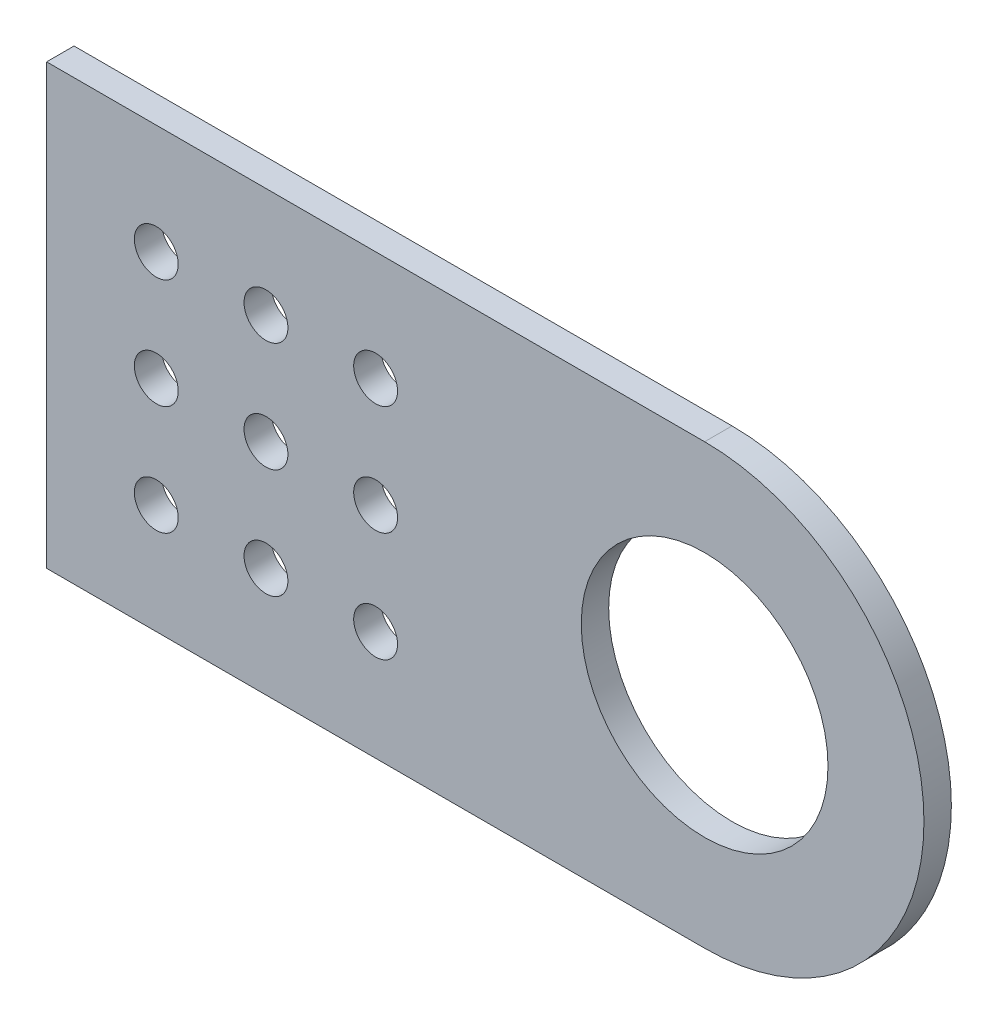
ISO-10303-21;
HEADER;
FILE_DESCRIPTION(('STEP AP214'),'2;1');
FILE_NAME('part.step','',(''),(''),'','','');
FILE_SCHEMA(('AUTOMOTIVE_DESIGN { 1 0 10303 214 1 1 1 1 }'));
ENDSEC;
DATA;
#1=APPLICATION_CONTEXT('core data for automotive mechanical design processes');
#2=APPLICATION_PROTOCOL_DEFINITION('international standard','automotive_design',2000,#1);
#3=PRODUCT_CONTEXT('',#1,'mechanical');
#4=PRODUCT('Part','Part','',(#3));
#5=PRODUCT_RELATED_PRODUCT_CATEGORY('part','',(#4));
#6=PRODUCT_DEFINITION_FORMATION('','',#4);
#7=PRODUCT_DEFINITION_CONTEXT('part definition',#1,'design');
#8=PRODUCT_DEFINITION('design','',#6,#7);
#9=PRODUCT_DEFINITION_SHAPE('','',#8);
#10=(LENGTH_UNIT() NAMED_UNIT(*) SI_UNIT(.MILLI.,.METRE.));
#11=(NAMED_UNIT(*) PLANE_ANGLE_UNIT() SI_UNIT($,.RADIAN.));
#12=(NAMED_UNIT(*) SI_UNIT($,.STERADIAN.) SOLID_ANGLE_UNIT());
#13=UNCERTAINTY_MEASURE_WITH_UNIT(LENGTH_MEASURE(1.E-05),#10,'distance_accuracy_value','');
#14=(GEOMETRIC_REPRESENTATION_CONTEXT(3) GLOBAL_UNCERTAINTY_ASSIGNED_CONTEXT((#13)) GLOBAL_UNIT_ASSIGNED_CONTEXT((#10,
#11,#12)) REPRESENTATION_CONTEXT('',''));
#15=CARTESIAN_POINT('',(0.,0.,0.));
#16=DIRECTION('',(0.,0.,1.));
#17=DIRECTION('',(1.,0.,0.));
#18=AXIS2_PLACEMENT_3D('',#15,#16,#17);
#19=CARTESIAN_POINT('',(76.2,25.3999999999999,3.175));
#20=DIRECTION('',(0.,0.,-1.));
#21=DIRECTION('',(-1.,0.,0.));
#22=AXIS2_PLACEMENT_3D('',#19,#20,#21);
#23=PLANE('',#22);
#24=DIRECTION('',(1.,0.,0.));
#25=VECTOR('',#24,1.);
#26=CARTESIAN_POINT('',(76.2,0.,3.175));
#27=LINE('',#26,#25);
#28=CARTESIAN_POINT('',(0.,0.,3.175));
#29=VERTEX_POINT('',#28);
#30=CARTESIAN_POINT('',(76.2,0.,3.175));
#31=VERTEX_POINT('',#30);
#32=EDGE_CURVE('E91',#29,#31,#27,.T.);
#33=ORIENTED_EDGE('',*,*,#32,.T.);
#34=CARTESIAN_POINT('',(76.2,25.3999999999999,3.175));
#35=DIRECTION('',(0.,0.,1.));
#36=DIRECTION('',(-1.,0.,0.));
#37=AXIS2_PLACEMENT_3D('',#34,#35,#36);
#38=CIRCLE('',#37,25.4);
#39=CARTESIAN_POINT('',(76.2,50.7999999999999,3.175));
#40=VERTEX_POINT('',#39);
#41=EDGE_CURVE('E86',#31,#40,#38,.T.);
#42=ORIENTED_EDGE('',*,*,#41,.T.);
#43=DIRECTION('',(-1.,0.,0.));
#44=VECTOR('',#43,1.);
#45=CARTESIAN_POINT('',(0.,50.7999999999999,3.175));
#46=LINE('',#45,#44);
#47=CARTESIAN_POINT('',(0.,50.7999999999999,3.175));
#48=VERTEX_POINT('',#47);
#49=EDGE_CURVE('E89',#40,#48,#46,.T.);
#50=ORIENTED_EDGE('',*,*,#49,.T.);
#51=DIRECTION('',(0.,-1.,0.));
#52=VECTOR('',#51,1.);
#53=CARTESIAN_POINT('',(0.,0.,3.175));
#54=LINE('',#53,#52);
#55=EDGE_CURVE('E56',#48,#29,#54,.T.);
#56=ORIENTED_EDGE('',*,*,#55,.T.);
#57=EDGE_LOOP('',(#33,#42,#50,#56));
#58=FACE_BOUND('',#57,.T.);
#59=CARTESIAN_POINT('',(12.7,38.0999999999999,3.175));
#60=DIRECTION('',(0.,0.,1.));
#61=DIRECTION('',(1.,0.,0.));
#62=AXIS2_PLACEMENT_3D('',#59,#60,#61);
#63=CIRCLE('',#62,2.54);
#64=CARTESIAN_POINT('',(15.24,38.0999999999999,3.175));
#65=VERTEX_POINT('',#64);
#66=EDGE_CURVE('E106',#65,#65,#63,.T.);
#67=ORIENTED_EDGE('',*,*,#66,.F.);
#68=EDGE_LOOP('',(#67));
#69=FACE_BOUND('',#68,.T.);
#70=CARTESIAN_POINT('',(76.2,25.3999999999999,3.175));
#71=DIRECTION('',(0.,0.,1.));
#72=DIRECTION('',(1.,0.,0.));
#73=AXIS2_PLACEMENT_3D('',#70,#71,#72);
#74=CIRCLE('',#73,14.2875);
#75=CARTESIAN_POINT('',(90.4875,25.3999999999999,3.175));
#76=VERTEX_POINT('',#75);
#77=EDGE_CURVE('E121',#76,#76,#74,.T.);
#78=ORIENTED_EDGE('',*,*,#77,.F.);
#79=EDGE_LOOP('',(#78));
#80=FACE_BOUND('',#79,.T.);
#81=CARTESIAN_POINT('',(25.4,38.0999999999999,3.175));
#82=DIRECTION('',(0.,0.,1.));
#83=DIRECTION('',(1.,0.,0.));
#84=AXIS2_PLACEMENT_3D('',#81,#82,#83);
#85=CIRCLE('',#84,2.54);
#86=CARTESIAN_POINT('',(27.94,38.0999999999999,3.175));
#87=VERTEX_POINT('',#86);
#88=EDGE_CURVE('E127',#87,#87,#85,.T.);
#89=ORIENTED_EDGE('',*,*,#88,.F.);
#90=EDGE_LOOP('',(#89));
#91=FACE_BOUND('',#90,.T.);
#92=CARTESIAN_POINT('',(38.1,38.0999999999999,3.175));
#93=DIRECTION('',(0.,0.,1.));
#94=DIRECTION('',(1.,0.,0.));
#95=AXIS2_PLACEMENT_3D('',#92,#93,#94);
#96=CIRCLE('',#95,2.54);
#97=CARTESIAN_POINT('',(40.64,38.0999999999999,3.175));
#98=VERTEX_POINT('',#97);
#99=EDGE_CURVE('E133',#98,#98,#96,.T.);
#100=ORIENTED_EDGE('',*,*,#99,.F.);
#101=EDGE_LOOP('',(#100));
#102=FACE_BOUND('',#101,.T.);
#103=CARTESIAN_POINT('',(25.4,25.3999999999999,3.175));
#104=DIRECTION('',(0.,0.,1.));
#105=DIRECTION('',(1.,0.,0.));
#106=AXIS2_PLACEMENT_3D('',#103,#104,#105);
#107=CIRCLE('',#106,2.54);
#108=CARTESIAN_POINT('',(27.94,25.3999999999999,3.175));
#109=VERTEX_POINT('',#108);
#110=EDGE_CURVE('E139',#109,#109,#107,.T.);
#111=ORIENTED_EDGE('',*,*,#110,.F.);
#112=EDGE_LOOP('',(#111));
#113=FACE_BOUND('',#112,.T.);
#114=CARTESIAN_POINT('',(38.1,25.3999999999999,3.175));
#115=DIRECTION('',(0.,0.,1.));
#116=DIRECTION('',(1.,0.,0.));
#117=AXIS2_PLACEMENT_3D('',#114,#115,#116);
#118=CIRCLE('',#117,2.54);
#119=CARTESIAN_POINT('',(40.64,25.3999999999999,3.175));
#120=VERTEX_POINT('',#119);
#121=EDGE_CURVE('E145',#120,#120,#118,.T.);
#122=ORIENTED_EDGE('',*,*,#121,.F.);
#123=EDGE_LOOP('',(#122));
#124=FACE_BOUND('',#123,.T.);
#125=CARTESIAN_POINT('',(25.4,12.6999999999999,3.175));
#126=DIRECTION('',(0.,0.,1.));
#127=DIRECTION('',(1.,0.,0.));
#128=AXIS2_PLACEMENT_3D('',#125,#126,#127);
#129=CIRCLE('',#128,2.54);
#130=CARTESIAN_POINT('',(27.94,12.6999999999999,3.175));
#131=VERTEX_POINT('',#130);
#132=EDGE_CURVE('E151',#131,#131,#129,.T.);
#133=ORIENTED_EDGE('',*,*,#132,.F.);
#134=EDGE_LOOP('',(#133));
#135=FACE_BOUND('',#134,.T.);
#136=CARTESIAN_POINT('',(38.1,12.6999999999999,3.175));
#137=DIRECTION('',(0.,0.,1.));
#138=DIRECTION('',(1.,0.,0.));
#139=AXIS2_PLACEMENT_3D('',#136,#137,#138);
#140=CIRCLE('',#139,2.54);
#141=CARTESIAN_POINT('',(40.64,12.6999999999999,3.175));
#142=VERTEX_POINT('',#141);
#143=EDGE_CURVE('E157',#142,#142,#140,.T.);
#144=ORIENTED_EDGE('',*,*,#143,.F.);
#145=EDGE_LOOP('',(#144));
#146=FACE_BOUND('',#145,.T.);
#147=CARTESIAN_POINT('',(12.7,25.3999999999999,3.175));
#148=DIRECTION('',(0.,0.,1.));
#149=DIRECTION('',(1.,0.,0.));
#150=AXIS2_PLACEMENT_3D('',#147,#148,#149);
#151=CIRCLE('',#150,2.54);
#152=CARTESIAN_POINT('',(15.24,25.3999999999999,3.175));
#153=VERTEX_POINT('',#152);
#154=EDGE_CURVE('E163',#153,#153,#151,.T.);
#155=ORIENTED_EDGE('',*,*,#154,.F.);
#156=EDGE_LOOP('',(#155));
#157=FACE_BOUND('',#156,.T.);
#158=CARTESIAN_POINT('',(12.7,12.6999999999999,3.175));
#159=DIRECTION('',(0.,0.,1.));
#160=DIRECTION('',(1.,0.,0.));
#161=AXIS2_PLACEMENT_3D('',#158,#159,#160);
#162=CIRCLE('',#161,2.54);
#163=CARTESIAN_POINT('',(15.24,12.6999999999999,3.175));
#164=VERTEX_POINT('',#163);
#165=EDGE_CURVE('E169',#164,#164,#162,.T.);
#166=ORIENTED_EDGE('',*,*,#165,.F.);
#167=EDGE_LOOP('',(#166));
#168=FACE_BOUND('',#167,.T.);
#169=ADVANCED_FACE('F39',(#58,#69,#80,#91,#102,#113,#124,#135,#146,#157,#168),#23,.F.);
#170=CARTESIAN_POINT('',(76.2,25.3999999999999,0.));
#171=DIRECTION('',(0.,0.,-1.));
#172=DIRECTION('',(-1.,0.,0.));
#173=AXIS2_PLACEMENT_3D('',#170,#171,#172);
#174=PLANE('',#173);
#175=CARTESIAN_POINT('',(12.7,25.3999999999999,0.));
#176=DIRECTION('',(0.,0.,1.));
#177=DIRECTION('',(1.,0.,0.));
#178=AXIS2_PLACEMENT_3D('',#175,#176,#177);
#179=CIRCLE('',#178,2.54);
#180=CARTESIAN_POINT('',(15.24,25.3999999999999,0.));
#181=VERTEX_POINT('',#180);
#182=EDGE_CURVE('E166',#181,#181,#179,.T.);
#183=ORIENTED_EDGE('',*,*,#182,.T.);
#184=EDGE_LOOP('',(#183));
#185=FACE_BOUND('',#184,.T.);
#186=CARTESIAN_POINT('',(25.4,12.6999999999999,0.));
#187=DIRECTION('',(0.,0.,1.));
#188=DIRECTION('',(1.,0.,0.));
#189=AXIS2_PLACEMENT_3D('',#186,#187,#188);
#190=CIRCLE('',#189,2.54);
#191=CARTESIAN_POINT('',(27.94,12.6999999999999,0.));
#192=VERTEX_POINT('',#191);
#193=EDGE_CURVE('E154',#192,#192,#190,.T.);
#194=ORIENTED_EDGE('',*,*,#193,.T.);
#195=EDGE_LOOP('',(#194));
#196=FACE_BOUND('',#195,.T.);
#197=CARTESIAN_POINT('',(25.4,25.3999999999999,0.));
#198=DIRECTION('',(0.,0.,1.));
#199=DIRECTION('',(1.,0.,0.));
#200=AXIS2_PLACEMENT_3D('',#197,#198,#199);
#201=CIRCLE('',#200,2.54);
#202=CARTESIAN_POINT('',(27.94,25.3999999999999,0.));
#203=VERTEX_POINT('',#202);
#204=EDGE_CURVE('E142',#203,#203,#201,.T.);
#205=ORIENTED_EDGE('',*,*,#204,.T.);
#206=EDGE_LOOP('',(#205));
#207=FACE_BOUND('',#206,.T.);
#208=CARTESIAN_POINT('',(25.4,38.0999999999999,0.));
#209=DIRECTION('',(0.,0.,1.));
#210=DIRECTION('',(1.,0.,0.));
#211=AXIS2_PLACEMENT_3D('',#208,#209,#210);
#212=CIRCLE('',#211,2.54);
#213=CARTESIAN_POINT('',(27.94,38.0999999999999,0.));
#214=VERTEX_POINT('',#213);
#215=EDGE_CURVE('E130',#214,#214,#212,.T.);
#216=ORIENTED_EDGE('',*,*,#215,.T.);
#217=EDGE_LOOP('',(#216));
#218=FACE_BOUND('',#217,.T.);
#219=CARTESIAN_POINT('',(12.7,38.0999999999999,0.));
#220=DIRECTION('',(0.,0.,1.));
#221=DIRECTION('',(1.,0.,0.));
#222=AXIS2_PLACEMENT_3D('',#219,#220,#221);
#223=CIRCLE('',#222,2.54);
#224=CARTESIAN_POINT('',(15.24,38.0999999999999,0.));
#225=VERTEX_POINT('',#224);
#226=EDGE_CURVE('E118',#225,#225,#223,.T.);
#227=ORIENTED_EDGE('',*,*,#226,.T.);
#228=EDGE_LOOP('',(#227));
#229=FACE_BOUND('',#228,.T.);
#230=DIRECTION('',(1.,0.,0.));
#231=VECTOR('',#230,1.);
#232=CARTESIAN_POINT('',(76.2,0.,0.));
#233=LINE('',#232,#231);
#234=CARTESIAN_POINT('',(0.,0.,0.));
#235=VERTEX_POINT('',#234);
#236=CARTESIAN_POINT('',(76.2,0.,0.));
#237=VERTEX_POINT('',#236);
#238=EDGE_CURVE('E103',#235,#237,#233,.T.);
#239=ORIENTED_EDGE('',*,*,#238,.F.);
#240=DIRECTION('',(0.,-1.,0.));
#241=VECTOR('',#240,1.);
#242=CARTESIAN_POINT('',(0.,0.,0.));
#243=LINE('',#242,#241);
#244=CARTESIAN_POINT('',(0.,50.7999999999999,0.));
#245=VERTEX_POINT('',#244);
#246=EDGE_CURVE('E79',#245,#235,#243,.T.);
#247=ORIENTED_EDGE('',*,*,#246,.F.);
#248=DIRECTION('',(-1.,0.,0.));
#249=VECTOR('',#248,1.);
#250=CARTESIAN_POINT('',(0.,50.7999999999999,0.));
#251=LINE('',#250,#249);
#252=CARTESIAN_POINT('',(76.2,50.7999999999999,0.));
#253=VERTEX_POINT('',#252);
#254=EDGE_CURVE('E73',#253,#245,#251,.T.);
#255=ORIENTED_EDGE('',*,*,#254,.F.);
#256=CARTESIAN_POINT('',(76.2,25.3999999999999,0.));
#257=DIRECTION('',(0.,0.,1.));
#258=DIRECTION('',(-1.,0.,0.));
#259=AXIS2_PLACEMENT_3D('',#256,#257,#258);
#260=CIRCLE('',#259,25.4);
#261=EDGE_CURVE('E95',#237,#253,#260,.T.);
#262=ORIENTED_EDGE('',*,*,#261,.F.);
#263=EDGE_LOOP('',(#239,#247,#255,#262));
#264=FACE_BOUND('',#263,.T.);
#265=CARTESIAN_POINT('',(76.2,25.3999999999999,0.));
#266=DIRECTION('',(0.,0.,1.));
#267=DIRECTION('',(1.,0.,0.));
#268=AXIS2_PLACEMENT_3D('',#265,#266,#267);
#269=CIRCLE('',#268,14.2875);
#270=CARTESIAN_POINT('',(90.4875,25.3999999999999,0.));
#271=VERTEX_POINT('',#270);
#272=EDGE_CURVE('E124',#271,#271,#269,.T.);
#273=ORIENTED_EDGE('',*,*,#272,.T.);
#274=EDGE_LOOP('',(#273));
#275=FACE_BOUND('',#274,.T.);
#276=CARTESIAN_POINT('',(38.1,38.0999999999999,0.));
#277=DIRECTION('',(0.,0.,1.));
#278=DIRECTION('',(1.,0.,0.));
#279=AXIS2_PLACEMENT_3D('',#276,#277,#278);
#280=CIRCLE('',#279,2.54);
#281=CARTESIAN_POINT('',(40.64,38.0999999999999,0.));
#282=VERTEX_POINT('',#281);
#283=EDGE_CURVE('E136',#282,#282,#280,.T.);
#284=ORIENTED_EDGE('',*,*,#283,.T.);
#285=EDGE_LOOP('',(#284));
#286=FACE_BOUND('',#285,.T.);
#287=CARTESIAN_POINT('',(38.1,25.3999999999999,0.));
#288=DIRECTION('',(0.,0.,1.));
#289=DIRECTION('',(1.,0.,0.));
#290=AXIS2_PLACEMENT_3D('',#287,#288,#289);
#291=CIRCLE('',#290,2.54);
#292=CARTESIAN_POINT('',(40.64,25.3999999999999,0.));
#293=VERTEX_POINT('',#292);
#294=EDGE_CURVE('E148',#293,#293,#291,.T.);
#295=ORIENTED_EDGE('',*,*,#294,.T.);
#296=EDGE_LOOP('',(#295));
#297=FACE_BOUND('',#296,.T.);
#298=CARTESIAN_POINT('',(38.1,12.6999999999999,0.));
#299=DIRECTION('',(0.,0.,1.));
#300=DIRECTION('',(1.,0.,0.));
#301=AXIS2_PLACEMENT_3D('',#298,#299,#300);
#302=CIRCLE('',#301,2.54);
#303=CARTESIAN_POINT('',(40.64,12.6999999999999,0.));
#304=VERTEX_POINT('',#303);
#305=EDGE_CURVE('E160',#304,#304,#302,.T.);
#306=ORIENTED_EDGE('',*,*,#305,.T.);
#307=EDGE_LOOP('',(#306));
#308=FACE_BOUND('',#307,.T.);
#309=CARTESIAN_POINT('',(12.7,12.6999999999999,0.));
#310=DIRECTION('',(0.,0.,1.));
#311=DIRECTION('',(1.,0.,0.));
#312=AXIS2_PLACEMENT_3D('',#309,#310,#311);
#313=CIRCLE('',#312,2.54);
#314=CARTESIAN_POINT('',(15.24,12.6999999999999,0.));
#315=VERTEX_POINT('',#314);
#316=EDGE_CURVE('E172',#315,#315,#313,.T.);
#317=ORIENTED_EDGE('',*,*,#316,.T.);
#318=EDGE_LOOP('',(#317));
#319=FACE_BOUND('',#318,.T.);
#320=ADVANCED_FACE('F114',(#185,#196,#207,#218,#229,#264,#275,#286,#297,#308,#319),#174,.T.);
#321=CARTESIAN_POINT('',(76.2,0.,3.175));
#322=DIRECTION('',(0.,1.,0.));
#323=DIRECTION('',(-1.,0.,0.));
#324=AXIS2_PLACEMENT_3D('',#321,#322,#323);
#325=PLANE('',#324);
#326=ORIENTED_EDGE('',*,*,#238,.T.);
#327=DIRECTION('',(0.,0.,-1.));
#328=VECTOR('',#327,1.);
#329=CARTESIAN_POINT('',(76.2,0.,3.175));
#330=LINE('',#329,#328);
#331=EDGE_CURVE('E11',#31,#237,#330,.T.);
#332=ORIENTED_EDGE('',*,*,#331,.F.);
#333=ORIENTED_EDGE('',*,*,#32,.F.);
#334=DIRECTION('',(0.,0.,-1.));
#335=VECTOR('',#334,1.);
#336=CARTESIAN_POINT('',(0.,0.,3.175));
#337=LINE('',#336,#335);
#338=EDGE_CURVE('E99',#29,#235,#337,.T.);
#339=ORIENTED_EDGE('',*,*,#338,.T.);
#340=EDGE_LOOP('',(#326,#332,#333,#339));
#341=FACE_BOUND('',#340,.T.);
#342=ADVANCED_FACE('F41',(#341),#325,.F.);
#343=CARTESIAN_POINT('',(76.2,25.3999999999999,3.175));
#344=DIRECTION('',(0.,0.,-1.));
#345=DIRECTION('',(-1.,0.,0.));
#346=AXIS2_PLACEMENT_3D('',#343,#344,#345);
#347=CYLINDRICAL_SURFACE('',#346,25.4);
#348=ORIENTED_EDGE('',*,*,#261,.T.);
#349=DIRECTION('',(0.,0.,-1.));
#350=VECTOR('',#349,1.);
#351=CARTESIAN_POINT('',(76.2,50.7999999999999,3.175));
#352=LINE('',#351,#350);
#353=EDGE_CURVE('E48',#40,#253,#352,.T.);
#354=ORIENTED_EDGE('',*,*,#353,.F.);
#355=ORIENTED_EDGE('',*,*,#41,.F.);
#356=ORIENTED_EDGE('',*,*,#331,.T.);
#357=EDGE_LOOP('',(#348,#354,#355,#356));
#358=FACE_BOUND('',#357,.T.);
#359=ADVANCED_FACE('F94',(#358),#347,.T.);
#360=CARTESIAN_POINT('',(0.,50.7999999999999,3.175));
#361=DIRECTION('',(0.,-1.,0.));
#362=DIRECTION('',(0.,0.,-1.));
#363=AXIS2_PLACEMENT_3D('',#360,#361,#362);
#364=PLANE('',#363);
#365=ORIENTED_EDGE('',*,*,#254,.T.);
#366=DIRECTION('',(0.,0.,-1.));
#367=VECTOR('',#366,1.);
#368=CARTESIAN_POINT('',(0.,50.7999999999999,3.175));
#369=LINE('',#368,#367);
#370=EDGE_CURVE('E96',#48,#245,#369,.T.);
#371=ORIENTED_EDGE('',*,*,#370,.F.);
#372=ORIENTED_EDGE('',*,*,#49,.F.);
#373=ORIENTED_EDGE('',*,*,#353,.T.);
#374=EDGE_LOOP('',(#365,#371,#372,#373));
#375=FACE_BOUND('',#374,.T.);
#376=ADVANCED_FACE('F97',(#375),#364,.F.);
#377=CARTESIAN_POINT('',(0.,0.,3.175));
#378=DIRECTION('',(1.,0.,0.));
#379=DIRECTION('',(0.,1.,0.));
#380=AXIS2_PLACEMENT_3D('',#377,#378,#379);
#381=PLANE('',#380);
#382=ORIENTED_EDGE('',*,*,#246,.T.);
#383=ORIENTED_EDGE('',*,*,#338,.F.);
#384=ORIENTED_EDGE('',*,*,#55,.F.);
#385=ORIENTED_EDGE('',*,*,#370,.T.);
#386=EDGE_LOOP('',(#382,#383,#384,#385));
#387=FACE_BOUND('',#386,.T.);
#388=ADVANCED_FACE('F111',(#387),#381,.F.);
#389=CARTESIAN_POINT('',(12.7,38.0999999999999,3.175));
#390=DIRECTION('',(0.,0.,-1.));
#391=DIRECTION('',(-1.,0.,0.));
#392=AXIS2_PLACEMENT_3D('',#389,#390,#391);
#393=CYLINDRICAL_SURFACE('',#392,2.54);
#394=ORIENTED_EDGE('',*,*,#66,.T.);
#395=EDGE_LOOP('',(#394));
#396=FACE_BOUND('',#395,.T.);
#397=ORIENTED_EDGE('',*,*,#226,.F.);
#398=EDGE_LOOP('',(#397));
#399=FACE_BOUND('',#398,.T.);
#400=ADVANCED_FACE('F189',(#396,#399),#393,.F.);
#401=CARTESIAN_POINT('',(76.2,25.3999999999999,3.175));
#402=DIRECTION('',(0.,0.,-1.));
#403=DIRECTION('',(-1.,0.,0.));
#404=AXIS2_PLACEMENT_3D('',#401,#402,#403);
#405=CYLINDRICAL_SURFACE('',#404,14.2875);
#406=ORIENTED_EDGE('',*,*,#77,.T.);
#407=EDGE_LOOP('',(#406));
#408=FACE_BOUND('',#407,.T.);
#409=ORIENTED_EDGE('',*,*,#272,.F.);
#410=EDGE_LOOP('',(#409));
#411=FACE_BOUND('',#410,.T.);
#412=ADVANCED_FACE('F234',(#408,#411),#405,.F.);
#413=CARTESIAN_POINT('',(25.4,38.0999999999999,3.175));
#414=DIRECTION('',(0.,0.,-1.));
#415=DIRECTION('',(-1.,0.,0.));
#416=AXIS2_PLACEMENT_3D('',#413,#414,#415);
#417=CYLINDRICAL_SURFACE('',#416,2.54);
#418=ORIENTED_EDGE('',*,*,#88,.T.);
#419=EDGE_LOOP('',(#418));
#420=FACE_BOUND('',#419,.T.);
#421=ORIENTED_EDGE('',*,*,#215,.F.);
#422=EDGE_LOOP('',(#421));
#423=FACE_BOUND('',#422,.T.);
#424=ADVANCED_FACE('F242',(#420,#423),#417,.F.);
#425=CARTESIAN_POINT('',(38.1,38.0999999999999,3.175));
#426=DIRECTION('',(0.,0.,-1.));
#427=DIRECTION('',(-1.,0.,0.));
#428=AXIS2_PLACEMENT_3D('',#425,#426,#427);
#429=CYLINDRICAL_SURFACE('',#428,2.54);
#430=ORIENTED_EDGE('',*,*,#99,.T.);
#431=EDGE_LOOP('',(#430));
#432=FACE_BOUND('',#431,.T.);
#433=ORIENTED_EDGE('',*,*,#283,.F.);
#434=EDGE_LOOP('',(#433));
#435=FACE_BOUND('',#434,.T.);
#436=ADVANCED_FACE('F250',(#432,#435),#429,.F.);
#437=CARTESIAN_POINT('',(25.4,25.3999999999999,3.175));
#438=DIRECTION('',(0.,0.,-1.));
#439=DIRECTION('',(-1.,0.,0.));
#440=AXIS2_PLACEMENT_3D('',#437,#438,#439);
#441=CYLINDRICAL_SURFACE('',#440,2.54);
#442=ORIENTED_EDGE('',*,*,#110,.T.);
#443=EDGE_LOOP('',(#442));
#444=FACE_BOUND('',#443,.T.);
#445=ORIENTED_EDGE('',*,*,#204,.F.);
#446=EDGE_LOOP('',(#445));
#447=FACE_BOUND('',#446,.T.);
#448=ADVANCED_FACE('F259',(#444,#447),#441,.F.);
#449=CARTESIAN_POINT('',(38.1,25.3999999999999,3.175));
#450=DIRECTION('',(0.,0.,-1.));
#451=DIRECTION('',(-1.,0.,0.));
#452=AXIS2_PLACEMENT_3D('',#449,#450,#451);
#453=CYLINDRICAL_SURFACE('',#452,2.54);
#454=ORIENTED_EDGE('',*,*,#121,.T.);
#455=EDGE_LOOP('',(#454));
#456=FACE_BOUND('',#455,.T.);
#457=ORIENTED_EDGE('',*,*,#294,.F.);
#458=EDGE_LOOP('',(#457));
#459=FACE_BOUND('',#458,.T.);
#460=ADVANCED_FACE('F268',(#456,#459),#453,.F.);
#461=CARTESIAN_POINT('',(25.4,12.6999999999999,3.175));
#462=DIRECTION('',(0.,0.,-1.));
#463=DIRECTION('',(-1.,0.,0.));
#464=AXIS2_PLACEMENT_3D('',#461,#462,#463);
#465=CYLINDRICAL_SURFACE('',#464,2.54);
#466=ORIENTED_EDGE('',*,*,#132,.T.);
#467=EDGE_LOOP('',(#466));
#468=FACE_BOUND('',#467,.T.);
#469=ORIENTED_EDGE('',*,*,#193,.F.);
#470=EDGE_LOOP('',(#469));
#471=FACE_BOUND('',#470,.T.);
#472=ADVANCED_FACE('F277',(#468,#471),#465,.F.);
#473=CARTESIAN_POINT('',(38.1,12.6999999999999,3.175));
#474=DIRECTION('',(0.,0.,-1.));
#475=DIRECTION('',(-1.,0.,0.));
#476=AXIS2_PLACEMENT_3D('',#473,#474,#475);
#477=CYLINDRICAL_SURFACE('',#476,2.54);
#478=ORIENTED_EDGE('',*,*,#143,.T.);
#479=EDGE_LOOP('',(#478));
#480=FACE_BOUND('',#479,.T.);
#481=ORIENTED_EDGE('',*,*,#305,.F.);
#482=EDGE_LOOP('',(#481));
#483=FACE_BOUND('',#482,.T.);
#484=ADVANCED_FACE('F286',(#480,#483),#477,.F.);
#485=CARTESIAN_POINT('',(12.7,25.3999999999999,3.175));
#486=DIRECTION('',(0.,0.,-1.));
#487=DIRECTION('',(-1.,0.,0.));
#488=AXIS2_PLACEMENT_3D('',#485,#486,#487);
#489=CYLINDRICAL_SURFACE('',#488,2.54);
#490=ORIENTED_EDGE('',*,*,#154,.T.);
#491=EDGE_LOOP('',(#490));
#492=FACE_BOUND('',#491,.T.);
#493=ORIENTED_EDGE('',*,*,#182,.F.);
#494=EDGE_LOOP('',(#493));
#495=FACE_BOUND('',#494,.T.);
#496=ADVANCED_FACE('F295',(#492,#495),#489,.F.);
#497=CARTESIAN_POINT('',(12.7,12.6999999999999,3.175));
#498=DIRECTION('',(0.,0.,-1.));
#499=DIRECTION('',(-1.,0.,0.));
#500=AXIS2_PLACEMENT_3D('',#497,#498,#499);
#501=CYLINDRICAL_SURFACE('',#500,2.54);
#502=ORIENTED_EDGE('',*,*,#165,.T.);
#503=EDGE_LOOP('',(#502));
#504=FACE_BOUND('',#503,.T.);
#505=ORIENTED_EDGE('',*,*,#316,.F.);
#506=EDGE_LOOP('',(#505));
#507=FACE_BOUND('',#506,.T.);
#508=ADVANCED_FACE('F178',(#504,#507),#501,.F.);
#509=CLOSED_SHELL('',(#169,#320,#342,#359,#376,#388,#400,#412,#424,#436,#448,#460,#472,#484,
#496,#508));
#510=MANIFOLD_SOLID_BREP('B2',#509);
#511=ADVANCED_BREP_SHAPE_REPRESENTATION('',(#18,#510),#14);
#512=SHAPE_DEFINITION_REPRESENTATION(#9,#511);
ENDSEC;
END-ISO-10303-21;
